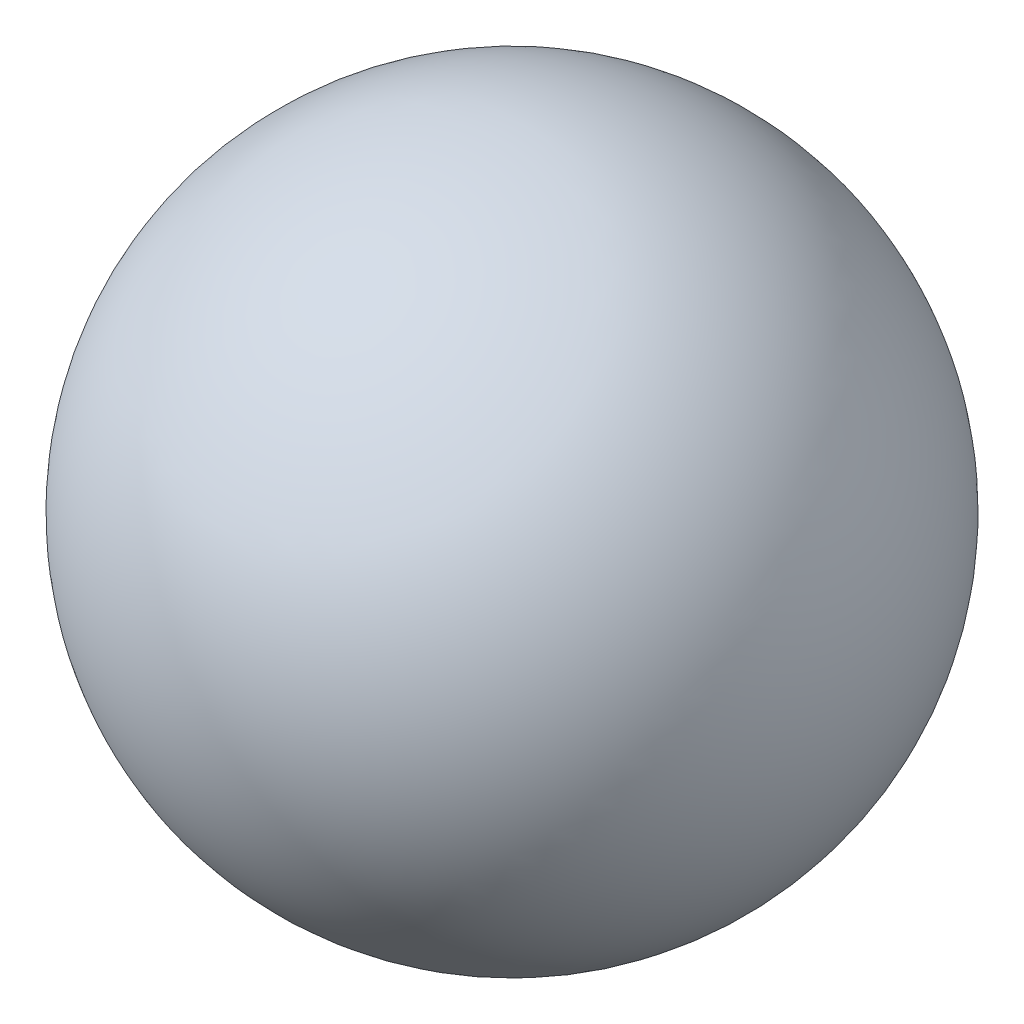
ISO-10303-21;
HEADER;
FILE_DESCRIPTION(('STEP AP214'),'2;1');
FILE_NAME('part.step','',(''),(''),'','','');
FILE_SCHEMA(('AUTOMOTIVE_DESIGN { 1 0 10303 214 1 1 1 1 }'));
ENDSEC;
DATA;
#1=APPLICATION_CONTEXT('core data for automotive mechanical design processes');
#2=APPLICATION_PROTOCOL_DEFINITION('international standard','automotive_design',2000,#1);
#3=PRODUCT_CONTEXT('',#1,'mechanical');
#4=PRODUCT('Part','Part','',(#3));
#5=PRODUCT_RELATED_PRODUCT_CATEGORY('part','',(#4));
#6=PRODUCT_DEFINITION_FORMATION('','',#4);
#7=PRODUCT_DEFINITION_CONTEXT('part definition',#1,'design');
#8=PRODUCT_DEFINITION('design','',#6,#7);
#9=PRODUCT_DEFINITION_SHAPE('','',#8);
#10=(LENGTH_UNIT() NAMED_UNIT(*) SI_UNIT(.MILLI.,.METRE.));
#11=(NAMED_UNIT(*) PLANE_ANGLE_UNIT() SI_UNIT($,.RADIAN.));
#12=(NAMED_UNIT(*) SI_UNIT($,.STERADIAN.) SOLID_ANGLE_UNIT());
#13=UNCERTAINTY_MEASURE_WITH_UNIT(LENGTH_MEASURE(1.E-05),#10,'distance_accuracy_value','');
#14=(GEOMETRIC_REPRESENTATION_CONTEXT(3) GLOBAL_UNCERTAINTY_ASSIGNED_CONTEXT((#13)) GLOBAL_UNIT_ASSIGNED_CONTEXT((#10,
#11,#12)) REPRESENTATION_CONTEXT('',''));
#15=CARTESIAN_POINT('',(0.,0.,0.));
#16=DIRECTION('',(0.,0.,1.));
#17=DIRECTION('',(1.,0.,0.));
#18=AXIS2_PLACEMENT_3D('',#15,#16,#17);
#19=CARTESIAN_POINT('',(4.36703385400882,-2.,10.9083232129389));
#20=DIRECTION('',(0.,0.,1.));
#21=DIRECTION('',(1.,0.,0.));
#22=AXIS2_PLACEMENT_3D('',#19,#20,#21);
#23=SPHERICAL_SURFACE('',#22,1.05);
#24=CARTESIAN_POINT('',(4.36703385400882,-2.,11.9583232129389));
#25=VERTEX_POINT('',#24);
#26=VERTEX_LOOP('',#25);
#27=FACE_BOUND('',#26,.T.);
#28=ADVANCED_FACE('F13',(#27),#23,.T.);
#29=CLOSED_SHELL('',(#28));
#30=MANIFOLD_SOLID_BREP('B1',#29);
#31=ADVANCED_BREP_SHAPE_REPRESENTATION('',(#18,#30),#14);
#32=SHAPE_DEFINITION_REPRESENTATION(#9,#31);
ENDSEC;
END-ISO-10303-21;
